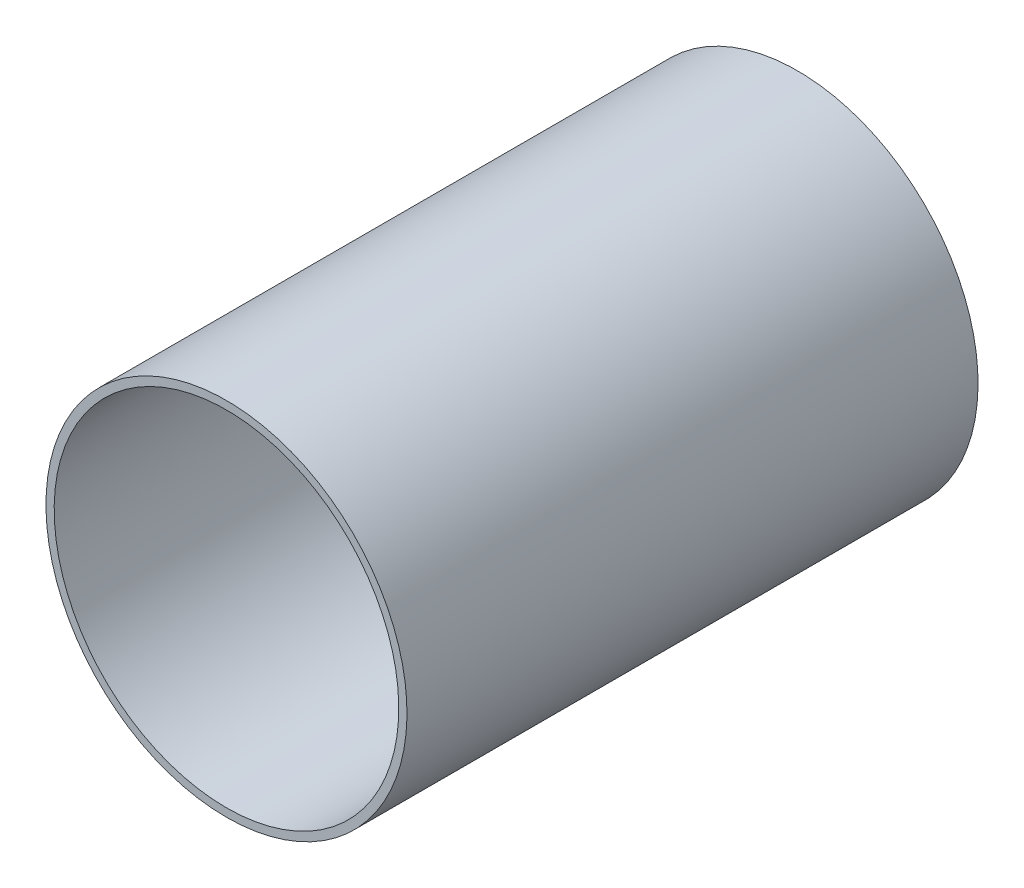
ISO-10303-21;
HEADER;
FILE_DESCRIPTION(('STEP AP214'),'2;1');
FILE_NAME('part.step','',(''),(''),'','','');
FILE_SCHEMA(('AUTOMOTIVE_DESIGN { 1 0 10303 214 1 1 1 1 }'));
ENDSEC;
DATA;
#1=APPLICATION_CONTEXT('core data for automotive mechanical design processes');
#2=APPLICATION_PROTOCOL_DEFINITION('international standard','automotive_design',2000,#1);
#3=PRODUCT_CONTEXT('',#1,'mechanical');
#4=PRODUCT('Part','Part','',(#3));
#5=PRODUCT_RELATED_PRODUCT_CATEGORY('part','',(#4));
#6=PRODUCT_DEFINITION_FORMATION('','',#4);
#7=PRODUCT_DEFINITION_CONTEXT('part definition',#1,'design');
#8=PRODUCT_DEFINITION('design','',#6,#7);
#9=PRODUCT_DEFINITION_SHAPE('','',#8);
#10=(LENGTH_UNIT() NAMED_UNIT(*) SI_UNIT(.MILLI.,.METRE.));
#11=(NAMED_UNIT(*) PLANE_ANGLE_UNIT() SI_UNIT($,.RADIAN.));
#12=(NAMED_UNIT(*) SI_UNIT($,.STERADIAN.) SOLID_ANGLE_UNIT());
#13=UNCERTAINTY_MEASURE_WITH_UNIT(LENGTH_MEASURE(1.E-05),#10,'distance_accuracy_value','');
#14=(GEOMETRIC_REPRESENTATION_CONTEXT(3) GLOBAL_UNCERTAINTY_ASSIGNED_CONTEXT((#13)) GLOBAL_UNIT_ASSIGNED_CONTEXT((#10,
#11,#12)) REPRESENTATION_CONTEXT('',''));
#15=CARTESIAN_POINT('',(0.,0.,0.));
#16=DIRECTION('',(0.,0.,1.));
#17=DIRECTION('',(1.,0.,0.));
#18=AXIS2_PLACEMENT_3D('',#15,#16,#17);
#19=CARTESIAN_POINT('',(126.802,-114.284,-0.045));
#20=DIRECTION('',(0.,0.,-1.));
#21=DIRECTION('',(0.,-1.,0.));
#22=AXIS2_PLACEMENT_3D('',#19,#20,#21);
#23=CYLINDRICAL_SURFACE('',#22,0.525);
#24=CARTESIAN_POINT('',(126.802,-114.284,-0.035));
#25=DIRECTION('',(0.,0.,-1.));
#26=DIRECTION('',(0.,-1.,0.));
#27=AXIS2_PLACEMENT_3D('',#24,#25,#26);
#28=CIRCLE('',#27,0.525);
#29=CARTESIAN_POINT('',(126.802,-114.809,-0.035));
#30=VERTEX_POINT('',#29);
#31=EDGE_CURVE('E64',#30,#30,#28,.T.);
#32=ORIENTED_EDGE('',*,*,#31,.T.);
#33=DIRECTION('',(0.,0.,1.));
#34=VECTOR('',#33,1.);
#35=CARTESIAN_POINT('',(126.802,-114.809,-0.045));
#36=LINE('',#35,#34);
#37=CARTESIAN_POINT('',(126.802,-114.809,1.705));
#38=VERTEX_POINT('',#37);
#39=EDGE_CURVE('E11',#30,#38,#36,.T.);
#40=ORIENTED_EDGE('',*,*,#39,.T.);
#41=CARTESIAN_POINT('',(126.802,-114.284,1.705));
#42=DIRECTION('',(0.,0.,-1.));
#43=DIRECTION('',(0.,-1.,0.));
#44=AXIS2_PLACEMENT_3D('',#41,#42,#43);
#45=CIRCLE('',#44,0.525);
#46=EDGE_CURVE('E20',#38,#38,#45,.T.);
#47=ORIENTED_EDGE('',*,*,#46,.F.);
#48=ORIENTED_EDGE('',*,*,#39,.F.);
#49=EDGE_LOOP('',(#32,#40,#47,#48));
#50=FACE_BOUND('',#49,.T.);
#51=ADVANCED_FACE('F17',(#50),#23,.F.);
#52=CARTESIAN_POINT('',(126.802,-114.834,1.705));
#53=DIRECTION('',(0.,0.,1.));
#54=DIRECTION('',(1.,0.,0.));
#55=AXIS2_PLACEMENT_3D('',#52,#53,#54);
#56=PLANE('',#55);
#57=ORIENTED_EDGE('',*,*,#46,.T.);
#58=EDGE_LOOP('',(#57));
#59=FACE_BOUND('',#58,.T.);
#60=CARTESIAN_POINT('',(126.802,-114.284,1.705));
#61=DIRECTION('',(0.,0.,1.));
#62=DIRECTION('',(0.,-1.,0.));
#63=AXIS2_PLACEMENT_3D('',#60,#61,#62);
#64=CIRCLE('',#63,0.55);
#65=CARTESIAN_POINT('',(126.802,-114.834,1.705));
#66=VERTEX_POINT('',#65);
#67=EDGE_CURVE('E56',#66,#66,#64,.T.);
#68=ORIENTED_EDGE('',*,*,#67,.T.);
#69=EDGE_LOOP('',(#68));
#70=FACE_BOUND('',#69,.T.);
#71=ADVANCED_FACE('F76',(#59,#70),#56,.T.);
#72=CARTESIAN_POINT('',(126.802,-114.834,-0.035));
#73=DIRECTION('',(0.,0.,1.));
#74=DIRECTION('',(1.,0.,0.));
#75=AXIS2_PLACEMENT_3D('',#72,#73,#74);
#76=PLANE('',#75);
#77=ORIENTED_EDGE('',*,*,#31,.F.);
#78=EDGE_LOOP('',(#77));
#79=FACE_BOUND('',#78,.T.);
#80=CARTESIAN_POINT('',(126.802,-114.284,-0.035));
#81=DIRECTION('',(0.,0.,1.));
#82=DIRECTION('',(0.,-1.,0.));
#83=AXIS2_PLACEMENT_3D('',#80,#81,#82);
#84=CIRCLE('',#83,0.55);
#85=CARTESIAN_POINT('',(126.802,-114.834,-0.035));
#86=VERTEX_POINT('',#85);
#87=EDGE_CURVE('E55',#86,#86,#84,.T.);
#88=ORIENTED_EDGE('',*,*,#87,.F.);
#89=EDGE_LOOP('',(#88));
#90=FACE_BOUND('',#89,.T.);
#91=ADVANCED_FACE('F84',(#79,#90),#76,.F.);
#92=CARTESIAN_POINT('',(126.802,-114.284,-0.035));
#93=DIRECTION('',(0.,0.,-1.));
#94=DIRECTION('',(0.,-1.,0.));
#95=AXIS2_PLACEMENT_3D('',#92,#93,#94);
#96=CYLINDRICAL_SURFACE('',#95,0.55);
#97=ORIENTED_EDGE('',*,*,#87,.T.);
#98=DIRECTION('',(0.,0.,1.));
#99=VECTOR('',#98,1.);
#100=CARTESIAN_POINT('',(126.802,-114.834,-0.035));
#101=LINE('',#100,#99);
#102=EDGE_CURVE('E52',#86,#66,#101,.T.);
#103=ORIENTED_EDGE('',*,*,#102,.T.);
#104=ORIENTED_EDGE('',*,*,#67,.F.);
#105=ORIENTED_EDGE('',*,*,#102,.F.);
#106=EDGE_LOOP('',(#97,#103,#104,#105));
#107=FACE_BOUND('',#106,.T.);
#108=ADVANCED_FACE('F53',(#107),#96,.T.);
#109=CLOSED_SHELL('',(#51,#71,#91,#108));
#110=MANIFOLD_SOLID_BREP('B1',#109);
#111=ADVANCED_BREP_SHAPE_REPRESENTATION('',(#18,#110),#14);
#112=SHAPE_DEFINITION_REPRESENTATION(#9,#111);
ENDSEC;
END-ISO-10303-21;
